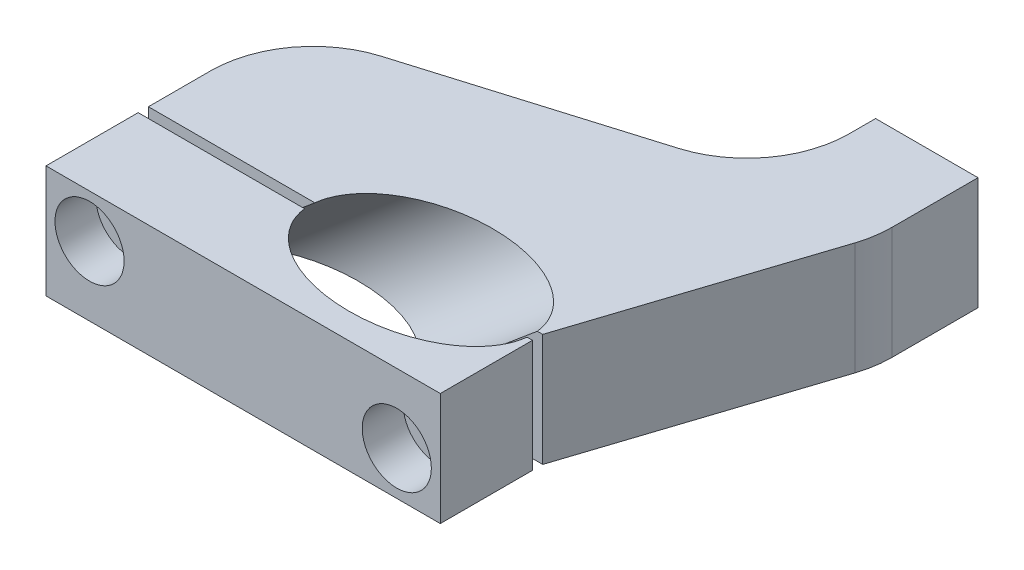
ISO-10303-21;
HEADER;
FILE_DESCRIPTION(('STEP AP214'),'2;1');
FILE_NAME('part.step','',(''),(''),'','','');
FILE_SCHEMA(('AUTOMOTIVE_DESIGN { 1 0 10303 214 1 1 1 1 }'));
ENDSEC;
DATA;
#1=APPLICATION_CONTEXT('core data for automotive mechanical design processes');
#2=APPLICATION_PROTOCOL_DEFINITION('international standard','automotive_design',2000,#1);
#3=PRODUCT_CONTEXT('',#1,'mechanical');
#4=PRODUCT('Part','Part','',(#3));
#5=PRODUCT_RELATED_PRODUCT_CATEGORY('part','',(#4));
#6=PRODUCT_DEFINITION_FORMATION('','',#4);
#7=PRODUCT_DEFINITION_CONTEXT('part definition',#1,'design');
#8=PRODUCT_DEFINITION('design','',#6,#7);
#9=PRODUCT_DEFINITION_SHAPE('','',#8);
#10=(LENGTH_UNIT() NAMED_UNIT(*) SI_UNIT(.MILLI.,.METRE.));
#11=(NAMED_UNIT(*) PLANE_ANGLE_UNIT() SI_UNIT($,.RADIAN.));
#12=(NAMED_UNIT(*) SI_UNIT($,.STERADIAN.) SOLID_ANGLE_UNIT());
#13=UNCERTAINTY_MEASURE_WITH_UNIT(LENGTH_MEASURE(1.E-05),#10,'distance_accuracy_value','');
#14=(GEOMETRIC_REPRESENTATION_CONTEXT(3) GLOBAL_UNCERTAINTY_ASSIGNED_CONTEXT((#13)) GLOBAL_UNIT_ASSIGNED_CONTEXT((#10,
#11,#12)) REPRESENTATION_CONTEXT('',''));
#15=CARTESIAN_POINT('',(0.,0.,0.));
#16=DIRECTION('',(0.,0.,1.));
#17=DIRECTION('',(1.,0.,0.));
#18=AXIS2_PLACEMENT_3D('',#15,#16,#17);
#19=CARTESIAN_POINT('',(-28.,22.,1.));
#20=DIRECTION('',(0.,0.,1.));
#21=DIRECTION('',(1.,0.,0.));
#22=AXIS2_PLACEMENT_3D('',#19,#20,#21);
#23=PLANE('',#22);
#24=CARTESIAN_POINT('',(-19.5,13.5,1.));
#25=DIRECTION('',(0.,0.,1.));
#26=DIRECTION('',(1.,0.,0.));
#27=AXIS2_PLACEMENT_3D('',#24,#25,#26);
#28=CIRCLE('',#27,4.);
#29=CARTESIAN_POINT('',(-15.5,13.5,1.));
#30=VERTEX_POINT('',#29);
#31=EDGE_CURVE('E168',#30,#30,#28,.T.);
#32=ORIENTED_EDGE('',*,*,#31,.T.);
#33=EDGE_LOOP('',(#32));
#34=FACE_BOUND('',#33,.T.);
#35=DIRECTION('',(-0.766044443118977,-0.64278760968654,0.));
#36=VECTOR('',#35,1.);
#37=CARTESIAN_POINT('',(-51.108484850367,-24.656090044851,1.));
#38=LINE('',#37,#36);
#39=CARTESIAN_POINT('',(-21.7245009600896,0.,1.));
#40=VERTEX_POINT('',#39);
#41=CARTESIAN_POINT('',(4.49407807698295,22.,1.));
#42=VERTEX_POINT('',#41);
#43=EDGE_CURVE('E118',#40,#42,#38,.F.);
#44=ORIENTED_EDGE('',*,*,#43,.F.);
#45=DIRECTION('',(-1.,0.,0.));
#46=VECTOR('',#45,1.);
#47=CARTESIAN_POINT('',(-28.,0.,1.));
#48=LINE('',#47,#46);
#49=CARTESIAN_POINT('',(-28.,0.,1.));
#50=VERTEX_POINT('',#49);
#51=EDGE_CURVE('E102',#40,#50,#48,.T.);
#52=ORIENTED_EDGE('',*,*,#51,.T.);
#53=DIRECTION('',(0.,-1.,0.));
#54=VECTOR('',#53,1.);
#55=CARTESIAN_POINT('',(-28.,22.,1.));
#56=LINE('',#55,#54);
#57=CARTESIAN_POINT('',(-28.,22.,1.));
#58=VERTEX_POINT('',#57);
#59=EDGE_CURVE('E136',#58,#50,#56,.T.);
#60=ORIENTED_EDGE('',*,*,#59,.F.);
#61=DIRECTION('',(-1.,0.,0.));
#62=VECTOR('',#61,1.);
#63=CARTESIAN_POINT('',(-28.,22.,1.));
#64=LINE('',#63,#62);
#65=EDGE_CURVE('E80',#42,#58,#64,.T.);
#66=ORIENTED_EDGE('',*,*,#65,.F.);
#67=EDGE_LOOP('',(#44,#52,#60,#66));
#68=FACE_BOUND('',#67,.T.);
#69=ADVANCED_FACE('F57',(#34,#68),#23,.F.);
#70=CARTESIAN_POINT('',(40.5,8.5,1.));
#71=DIRECTION('',(0.,0.,1.));
#72=DIRECTION('',(1.,0.,0.));
#73=AXIS2_PLACEMENT_3D('',#70,#71,#72);
#74=CIRCLE('',#73,4.);
#75=CARTESIAN_POINT('',(44.5,8.5,1.));
#76=VERTEX_POINT('',#75);
#77=EDGE_CURVE('E173',#76,#76,#74,.T.);
#78=ORIENTED_EDGE('',*,*,#77,.T.);
#79=EDGE_LOOP('',(#78));
#80=FACE_BOUND('',#79,.T.);
#81=DIRECTION('',(-0.766044443118977,-0.64278760968654,0.));
#82=VECTOR('',#81,1.);
#83=CARTESIAN_POINT('',(-33.1564038927204,-46.0505470206684,1.));
#84=LINE('',#83,#82);
#85=CARTESIAN_POINT('',(47.9430799971621,22.,1.));
#86=VERTEX_POINT('',#85);
#87=CARTESIAN_POINT('',(21.7245009600896,0.,1.));
#88=VERTEX_POINT('',#87);
#89=EDGE_CURVE('E72',#86,#88,#84,.T.);
#90=ORIENTED_EDGE('',*,*,#89,.F.);
#91=CARTESIAN_POINT('',(49.,22.,1.));
#92=VERTEX_POINT('',#91);
#93=EDGE_CURVE('E139',#92,#86,#64,.T.);
#94=ORIENTED_EDGE('',*,*,#93,.F.);
#95=DIRECTION('',(0.,-1.,0.));
#96=VECTOR('',#95,1.);
#97=CARTESIAN_POINT('',(49.,22.,1.));
#98=LINE('',#97,#96);
#99=CARTESIAN_POINT('',(49.,0.,1.));
#100=VERTEX_POINT('',#99);
#101=EDGE_CURVE('E138',#92,#100,#98,.T.);
#102=ORIENTED_EDGE('',*,*,#101,.T.);
#103=EDGE_CURVE('E128',#100,#88,#48,.T.);
#104=ORIENTED_EDGE('',*,*,#103,.T.);
#105=EDGE_LOOP('',(#90,#94,#102,#104));
#106=FACE_BOUND('',#105,.T.);
#107=ADVANCED_FACE('F210',(#80,#106),#23,.F.);
#108=CARTESIAN_POINT('',(0.,22.,0.));
#109=DIRECTION('',(0.,-1.,0.));
#110=DIRECTION('',(0.,0.,-1.));
#111=AXIS2_PLACEMENT_3D('',#108,#109,#110);
#112=PLANE('',#111);
#113=CARTESIAN_POINT('',(26.2185790370725,22.,0.));
#114=DIRECTION('',(0.,-1.,0.));
#115=DIRECTION('',(-1.,0.,0.));
#116=AXIS2_PLACEMENT_3D('',#113,#114,#115);
#117=ELLIPSE('',#116,21.7801335760457,14.);
#118=EDGE_CURVE('E122',#42,#86,#117,.F.);
#119=ORIENTED_EDGE('',*,*,#118,.F.);
#120=ORIENTED_EDGE('',*,*,#65,.T.);
#121=DIRECTION('',(0.,0.,1.));
#122=VECTOR('',#121,1.);
#123=CARTESIAN_POINT('',(-28.,22.,1.));
#124=LINE('',#123,#122);
#125=CARTESIAN_POINT('',(-28.,22.,19.));
#126=VERTEX_POINT('',#125);
#127=EDGE_CURVE('E131',#58,#126,#124,.T.);
#128=ORIENTED_EDGE('',*,*,#127,.T.);
#129=DIRECTION('',(1.,0.,0.));
#130=VECTOR('',#129,1.);
#131=CARTESIAN_POINT('',(49.,22.,19.));
#132=LINE('',#131,#130);
#133=CARTESIAN_POINT('',(49.,22.,19.));
#134=VERTEX_POINT('',#133);
#135=EDGE_CURVE('E110',#126,#134,#132,.T.);
#136=ORIENTED_EDGE('',*,*,#135,.T.);
#137=DIRECTION('',(0.,0.,-1.));
#138=VECTOR('',#137,1.);
#139=CARTESIAN_POINT('',(49.,22.,1.));
#140=LINE('',#139,#138);
#141=EDGE_CURVE('E153',#134,#92,#140,.T.);
#142=ORIENTED_EDGE('',*,*,#141,.T.);
#143=ORIENTED_EDGE('',*,*,#93,.T.);
#144=EDGE_LOOP('',(#119,#120,#128,#136,#142,#143));
#145=FACE_BOUND('',#144,.T.);
#146=ADVANCED_FACE('F216',(#145),#112,.F.);
#147=CARTESIAN_POINT('',(0.,0.,0.));
#148=DIRECTION('',(0.,-1.,0.));
#149=DIRECTION('',(0.,0.,-1.));
#150=AXIS2_PLACEMENT_3D('',#147,#148,#149);
#151=PLANE('',#150);
#152=ORIENTED_EDGE('',*,*,#51,.F.);
#153=CARTESIAN_POINT('',(0.,0.,0.));
#154=DIRECTION('',(0.,-1.,0.));
#155=DIRECTION('',(-1.,0.,0.));
#156=AXIS2_PLACEMENT_3D('',#153,#154,#155);
#157=ELLIPSE('',#156,21.7801335760457,14.);
#158=EDGE_CURVE('E14',#40,#88,#157,.F.);
#159=ORIENTED_EDGE('',*,*,#158,.T.);
#160=ORIENTED_EDGE('',*,*,#103,.F.);
#161=DIRECTION('',(0.,0.,-1.));
#162=VECTOR('',#161,1.);
#163=CARTESIAN_POINT('',(49.,0.,1.));
#164=LINE('',#163,#162);
#165=CARTESIAN_POINT('',(49.,0.,19.));
#166=VERTEX_POINT('',#165);
#167=EDGE_CURVE('E129',#166,#100,#164,.T.);
#168=ORIENTED_EDGE('',*,*,#167,.F.);
#169=DIRECTION('',(1.,0.,0.));
#170=VECTOR('',#169,1.);
#171=CARTESIAN_POINT('',(49.,0.,19.));
#172=LINE('',#171,#170);
#173=CARTESIAN_POINT('',(-28.,0.,19.));
#174=VERTEX_POINT('',#173);
#175=EDGE_CURVE('E132',#174,#166,#172,.T.);
#176=ORIENTED_EDGE('',*,*,#175,.F.);
#177=DIRECTION('',(0.,0.,1.));
#178=VECTOR('',#177,1.);
#179=CARTESIAN_POINT('',(-28.,0.,1.));
#180=LINE('',#179,#178);
#181=EDGE_CURVE('E127',#50,#174,#180,.T.);
#182=ORIENTED_EDGE('',*,*,#181,.F.);
#183=EDGE_LOOP('',(#152,#159,#160,#168,#176,#182));
#184=FACE_BOUND('',#183,.T.);
#185=ADVANCED_FACE('F125',(#184),#151,.T.);
#186=CARTESIAN_POINT('',(-28.,22.,1.));
#187=DIRECTION('',(1.,0.,0.));
#188=DIRECTION('',(0.,0.,-1.));
#189=AXIS2_PLACEMENT_3D('',#186,#187,#188);
#190=PLANE('',#189);
#191=ORIENTED_EDGE('',*,*,#181,.T.);
#192=DIRECTION('',(0.,-1.,0.));
#193=VECTOR('',#192,1.);
#194=CARTESIAN_POINT('',(-28.,22.,19.));
#195=LINE('',#194,#193);
#196=EDGE_CURVE('E65',#126,#174,#195,.T.);
#197=ORIENTED_EDGE('',*,*,#196,.F.);
#198=ORIENTED_EDGE('',*,*,#127,.F.);
#199=ORIENTED_EDGE('',*,*,#59,.T.);
#200=EDGE_LOOP('',(#191,#197,#198,#199));
#201=FACE_BOUND('',#200,.T.);
#202=ADVANCED_FACE('F59',(#201),#190,.F.);
#203=CARTESIAN_POINT('',(49.,22.,19.));
#204=DIRECTION('',(0.,0.,-1.));
#205=DIRECTION('',(-1.,0.,0.));
#206=AXIS2_PLACEMENT_3D('',#203,#204,#205);
#207=PLANE('',#206);
#208=CARTESIAN_POINT('',(40.5,8.5,19.));
#209=DIRECTION('',(0.,0.,1.));
#210=DIRECTION('',(1.,0.,0.));
#211=AXIS2_PLACEMENT_3D('',#208,#209,#210);
#212=CIRCLE('',#211,6.75);
#213=CARTESIAN_POINT('',(47.25,8.5,19.));
#214=VERTEX_POINT('',#213);
#215=EDGE_CURVE('E162',#214,#214,#212,.T.);
#216=ORIENTED_EDGE('',*,*,#215,.F.);
#217=EDGE_LOOP('',(#216));
#218=FACE_BOUND('',#217,.T.);
#219=CARTESIAN_POINT('',(-19.5,13.5,19.));
#220=DIRECTION('',(0.,0.,1.));
#221=DIRECTION('',(1.,0.,0.));
#222=AXIS2_PLACEMENT_3D('',#219,#220,#221);
#223=CIRCLE('',#222,6.75);
#224=CARTESIAN_POINT('',(-12.75,13.5,19.));
#225=VERTEX_POINT('',#224);
#226=EDGE_CURVE('E159',#225,#225,#223,.T.);
#227=ORIENTED_EDGE('',*,*,#226,.F.);
#228=EDGE_LOOP('',(#227));
#229=FACE_BOUND('',#228,.T.);
#230=ORIENTED_EDGE('',*,*,#175,.T.);
#231=DIRECTION('',(0.,-1.,0.));
#232=VECTOR('',#231,1.);
#233=CARTESIAN_POINT('',(49.,22.,19.));
#234=LINE('',#233,#232);
#235=EDGE_CURVE('E142',#134,#166,#234,.T.);
#236=ORIENTED_EDGE('',*,*,#235,.F.);
#237=ORIENTED_EDGE('',*,*,#135,.F.);
#238=ORIENTED_EDGE('',*,*,#196,.T.);
#239=EDGE_LOOP('',(#230,#236,#237,#238));
#240=FACE_BOUND('',#239,.T.);
#241=ADVANCED_FACE('F145',(#218,#229,#240),#207,.F.);
#242=CARTESIAN_POINT('',(49.,22.,1.));
#243=DIRECTION('',(-1.,0.,0.));
#244=DIRECTION('',(0.,0.,1.));
#245=AXIS2_PLACEMENT_3D('',#242,#243,#244);
#246=PLANE('',#245);
#247=ORIENTED_EDGE('',*,*,#167,.T.);
#248=ORIENTED_EDGE('',*,*,#101,.F.);
#249=ORIENTED_EDGE('',*,*,#141,.F.);
#250=ORIENTED_EDGE('',*,*,#235,.T.);
#251=EDGE_LOOP('',(#247,#248,#249,#250));
#252=FACE_BOUND('',#251,.T.);
#253=ADVANCED_FACE('F200',(#252),#246,.F.);
#254=CARTESIAN_POINT('',(-42.1324443715437,-35.3533185327597,0.));
#255=DIRECTION('',(-0.766044443118977,-0.64278760968654,0.));
#256=DIRECTION('',(0.642787609686541,-0.766044443118977,0.));
#257=AXIS2_PLACEMENT_3D('',#254,#255,#256);
#258=CYLINDRICAL_SURFACE('',#257,14.);
#259=ORIENTED_EDGE('',*,*,#118,.T.);
#260=ORIENTED_EDGE('',*,*,#89,.T.);
#261=ORIENTED_EDGE('',*,*,#158,.F.);
#262=ORIENTED_EDGE('',*,*,#43,.T.);
#263=EDGE_LOOP('',(#259,#260,#261,#262));
#264=FACE_BOUND('',#263,.T.);
#265=ADVANCED_FACE('F117',(#264),#258,.F.);
#266=CARTESIAN_POINT('',(-19.5,13.5,11.));
#267=DIRECTION('',(0.,0.,1.));
#268=DIRECTION('',(1.,0.,0.));
#269=AXIS2_PLACEMENT_3D('',#266,#267,#268);
#270=CYLINDRICAL_SURFACE('',#269,6.75);
#271=CARTESIAN_POINT('',(-19.5,13.5,11.));
#272=DIRECTION('',(0.,0.,1.));
#273=DIRECTION('',(1.,0.,0.));
#274=AXIS2_PLACEMENT_3D('',#271,#272,#273);
#275=CIRCLE('',#274,6.75);
#276=CARTESIAN_POINT('',(-12.75,13.5,11.));
#277=VERTEX_POINT('',#276);
#278=EDGE_CURVE('E158',#277,#277,#275,.T.);
#279=ORIENTED_EDGE('',*,*,#278,.F.);
#280=EDGE_LOOP('',(#279));
#281=FACE_BOUND('',#280,.T.);
#282=ORIENTED_EDGE('',*,*,#226,.T.);
#283=EDGE_LOOP('',(#282));
#284=FACE_BOUND('',#283,.T.);
#285=ADVANCED_FACE('F190',(#281,#284),#270,.F.);
#286=CARTESIAN_POINT('',(-19.5,13.5,11.));
#287=DIRECTION('',(0.,0.,1.));
#288=DIRECTION('',(1.,0.,0.));
#289=AXIS2_PLACEMENT_3D('',#286,#287,#288);
#290=PLANE('',#289);
#291=CARTESIAN_POINT('',(-19.5,13.5,11.));
#292=DIRECTION('',(0.,0.,1.));
#293=DIRECTION('',(1.,0.,0.));
#294=AXIS2_PLACEMENT_3D('',#291,#292,#293);
#295=CIRCLE('',#294,4.);
#296=CARTESIAN_POINT('',(-15.5,13.5,11.));
#297=VERTEX_POINT('',#296);
#298=EDGE_CURVE('E176',#297,#297,#295,.T.);
#299=ORIENTED_EDGE('',*,*,#298,.F.);
#300=EDGE_LOOP('',(#299));
#301=FACE_BOUND('',#300,.T.);
#302=ORIENTED_EDGE('',*,*,#278,.T.);
#303=EDGE_LOOP('',(#302));
#304=FACE_BOUND('',#303,.T.);
#305=ADVANCED_FACE('F186',(#301,#304),#290,.T.);
#306=CARTESIAN_POINT('',(40.5,8.5,11.));
#307=DIRECTION('',(0.,0.,1.));
#308=DIRECTION('',(1.,0.,0.));
#309=AXIS2_PLACEMENT_3D('',#306,#307,#308);
#310=CYLINDRICAL_SURFACE('',#309,6.75);
#311=CARTESIAN_POINT('',(40.5,8.5,11.));
#312=DIRECTION('',(0.,0.,1.));
#313=DIRECTION('',(1.,0.,0.));
#314=AXIS2_PLACEMENT_3D('',#311,#312,#313);
#315=CIRCLE('',#314,6.75);
#316=CARTESIAN_POINT('',(47.25,8.5,11.));
#317=VERTEX_POINT('',#316);
#318=EDGE_CURVE('E165',#317,#317,#315,.T.);
#319=ORIENTED_EDGE('',*,*,#318,.F.);
#320=EDGE_LOOP('',(#319));
#321=FACE_BOUND('',#320,.T.);
#322=ORIENTED_EDGE('',*,*,#215,.T.);
#323=EDGE_LOOP('',(#322));
#324=FACE_BOUND('',#323,.T.);
#325=ADVANCED_FACE('F189',(#321,#324),#310,.F.);
#326=CARTESIAN_POINT('',(40.5,8.5,11.));
#327=DIRECTION('',(0.,0.,1.));
#328=DIRECTION('',(1.,0.,0.));
#329=AXIS2_PLACEMENT_3D('',#326,#327,#328);
#330=PLANE('',#329);
#331=CARTESIAN_POINT('',(40.5,8.5,11.));
#332=DIRECTION('',(0.,0.,1.));
#333=DIRECTION('',(1.,0.,0.));
#334=AXIS2_PLACEMENT_3D('',#331,#332,#333);
#335=CIRCLE('',#334,4.);
#336=CARTESIAN_POINT('',(44.5,8.5,11.));
#337=VERTEX_POINT('',#336);
#338=EDGE_CURVE('E177',#337,#337,#335,.T.);
#339=ORIENTED_EDGE('',*,*,#338,.F.);
#340=EDGE_LOOP('',(#339));
#341=FACE_BOUND('',#340,.T.);
#342=ORIENTED_EDGE('',*,*,#318,.T.);
#343=EDGE_LOOP('',(#342));
#344=FACE_BOUND('',#343,.T.);
#345=ADVANCED_FACE('F225',(#341,#344),#330,.T.);
#346=CARTESIAN_POINT('',(40.5,8.5,-19.));
#347=DIRECTION('',(0.,0.,1.));
#348=DIRECTION('',(1.,0.,0.));
#349=AXIS2_PLACEMENT_3D('',#346,#347,#348);
#350=CYLINDRICAL_SURFACE('',#349,4.);
#351=ORIENTED_EDGE('',*,*,#338,.T.);
#352=EDGE_LOOP('',(#351));
#353=FACE_BOUND('',#352,.T.);
#354=ORIENTED_EDGE('',*,*,#77,.F.);
#355=EDGE_LOOP('',(#354));
#356=FACE_BOUND('',#355,.T.);
#357=ADVANCED_FACE('F228',(#353,#356),#350,.F.);
#358=CARTESIAN_POINT('',(-19.5,13.5,-19.));
#359=DIRECTION('',(0.,0.,1.));
#360=DIRECTION('',(1.,0.,0.));
#361=AXIS2_PLACEMENT_3D('',#358,#359,#360);
#362=CYLINDRICAL_SURFACE('',#361,4.);
#363=ORIENTED_EDGE('',*,*,#298,.T.);
#364=EDGE_LOOP('',(#363));
#365=FACE_BOUND('',#364,.T.);
#366=ORIENTED_EDGE('',*,*,#31,.F.);
#367=EDGE_LOOP('',(#366));
#368=FACE_BOUND('',#367,.T.);
#369=ADVANCED_FACE('F183',(#365,#368),#362,.F.);
#370=CLOSED_SHELL('',(#69,#107,#146,#185,#202,#241,#253,#265,#285,#305,#325,#345,#357,#369));
#371=MANIFOLD_SOLID_BREP('B2',#370);
#372=CARTESIAN_POINT('',(-28.,22.,-1.));
#373=DIRECTION('',(0.,0.,-1.));
#374=DIRECTION('',(-1.,0.,0.));
#375=AXIS2_PLACEMENT_3D('',#372,#373,#374);
#376=PLANE('',#375);
#377=CARTESIAN_POINT('',(40.5,8.5,-1.));
#378=DIRECTION('',(0.,0.,-1.));
#379=DIRECTION('',(-1.,0.,0.));
#380=AXIS2_PLACEMENT_3D('',#377,#378,#379);
#381=CIRCLE('',#380,4.);
#382=CARTESIAN_POINT('',(36.5,8.5,-1.));
#383=VERTEX_POINT('',#382);
#384=EDGE_CURVE('E500',#383,#383,#381,.T.);
#385=ORIENTED_EDGE('',*,*,#384,.T.);
#386=EDGE_LOOP('',(#385));
#387=FACE_BOUND('',#386,.T.);
#388=DIRECTION('',(-0.766044443118977,-0.64278760968654,0.));
#389=VECTOR('',#388,1.);
#390=CARTESIAN_POINT('',(-33.1564038927204,-46.0505470206684,-1.));
#391=LINE('',#390,#389);
#392=CARTESIAN_POINT('',(21.7245009600896,0.,-1.));
#393=VERTEX_POINT('',#392);
#394=CARTESIAN_POINT('',(47.9430799971621,22.,-1.));
#395=VERTEX_POINT('',#394);
#396=EDGE_CURVE('E429',#393,#395,#391,.F.);
#397=ORIENTED_EDGE('',*,*,#396,.F.);
#398=DIRECTION('',(1.,0.,0.));
#399=VECTOR('',#398,1.);
#400=CARTESIAN_POINT('',(-28.,0.,-1.));
#401=LINE('',#400,#399);
#402=CARTESIAN_POINT('',(49.,0.,-1.));
#403=VERTEX_POINT('',#402);
#404=EDGE_CURVE('E442',#393,#403,#401,.T.);
#405=ORIENTED_EDGE('',*,*,#404,.T.);
#406=DIRECTION('',(0.,-1.,0.));
#407=VECTOR('',#406,1.);
#408=CARTESIAN_POINT('',(49.,22.,-1.));
#409=LINE('',#408,#407);
#410=CARTESIAN_POINT('',(49.,22.,-1.));
#411=VERTEX_POINT('',#410);
#412=EDGE_CURVE('E475',#411,#403,#409,.T.);
#413=ORIENTED_EDGE('',*,*,#412,.F.);
#414=DIRECTION('',(1.,0.,0.));
#415=VECTOR('',#414,1.);
#416=CARTESIAN_POINT('',(-28.,22.,-1.));
#417=LINE('',#416,#415);
#418=EDGE_CURVE('E444',#395,#411,#417,.T.);
#419=ORIENTED_EDGE('',*,*,#418,.F.);
#420=EDGE_LOOP('',(#397,#405,#413,#419));
#421=FACE_BOUND('',#420,.T.);
#422=ADVANCED_FACE('F338',(#387,#421),#376,.F.);
#423=CARTESIAN_POINT('',(-19.5,13.5,-1.));
#424=DIRECTION('',(0.,0.,-1.));
#425=DIRECTION('',(-1.,0.,0.));
#426=AXIS2_PLACEMENT_3D('',#423,#424,#425);
#427=CIRCLE('',#426,4.);
#428=CARTESIAN_POINT('',(-23.5,13.5,-1.));
#429=VERTEX_POINT('',#428);
#430=EDGE_CURVE('E497',#429,#429,#427,.T.);
#431=ORIENTED_EDGE('',*,*,#430,.T.);
#432=EDGE_LOOP('',(#431));
#433=FACE_BOUND('',#432,.T.);
#434=DIRECTION('',(-0.766044443118977,-0.64278760968654,0.));
#435=VECTOR('',#434,1.);
#436=CARTESIAN_POINT('',(-51.108484850367,-24.656090044851,-1.));
#437=LINE('',#436,#435);
#438=CARTESIAN_POINT('',(4.49407807698295,22.,-1.));
#439=VERTEX_POINT('',#438);
#440=CARTESIAN_POINT('',(-21.7245009600896,0.,-1.));
#441=VERTEX_POINT('',#440);
#442=EDGE_CURVE('E432',#439,#441,#437,.T.);
#443=ORIENTED_EDGE('',*,*,#442,.F.);
#444=CARTESIAN_POINT('',(-28.,22.,-1.));
#445=VERTEX_POINT('',#444);
#446=EDGE_CURVE('E518',#445,#439,#417,.T.);
#447=ORIENTED_EDGE('',*,*,#446,.F.);
#448=DIRECTION('',(0.,-1.,0.));
#449=VECTOR('',#448,1.);
#450=CARTESIAN_POINT('',(-28.,22.,-1.));
#451=LINE('',#450,#449);
#452=CARTESIAN_POINT('',(-28.,0.,-1.));
#453=VERTEX_POINT('',#452);
#454=EDGE_CURVE('E437',#445,#453,#451,.T.);
#455=ORIENTED_EDGE('',*,*,#454,.T.);
#456=EDGE_CURVE('E451',#453,#441,#401,.T.);
#457=ORIENTED_EDGE('',*,*,#456,.T.);
#458=EDGE_LOOP('',(#443,#447,#455,#457));
#459=FACE_BOUND('',#458,.T.);
#460=ADVANCED_FACE('F516',(#433,#459),#376,.F.);
#461=CARTESIAN_POINT('',(0.,22.,0.));
#462=DIRECTION('',(0.,1.,0.));
#463=DIRECTION('',(0.,0.,1.));
#464=AXIS2_PLACEMENT_3D('',#461,#462,#463);
#465=PLANE('',#464);
#466=DIRECTION('',(-0.95746453985962,0.,0.288550957217968));
#467=VECTOR('',#466,1.);
#468=CARTESIAN_POINT('',(-28.,22.,-28.));
#469=LINE('',#468,#467);
#470=CARTESIAN_POINT('',(30.7710191443594,22.,-45.7118139887111));
#471=VERTEX_POINT('',#470);
#472=CARTESIAN_POINT('',(-13.7710191443594,22.,-32.288186011289));
#473=VERTEX_POINT('',#472);
#474=EDGE_CURVE('E472',#471,#473,#469,.T.);
#475=ORIENTED_EDGE('',*,*,#474,.T.);
#476=CARTESIAN_POINT('',(-8.,22.,-13.1388952140966));
#477=DIRECTION('',(0.,1.,0.));
#478=DIRECTION('',(0.,0.,1.));
#479=AXIS2_PLACEMENT_3D('',#476,#477,#478);
#480=CIRCLE('',#479,20.);
#481=CARTESIAN_POINT('',(-28.,22.,-13.1388952140966));
#482=VERTEX_POINT('',#481);
#483=EDGE_CURVE('E55',#473,#482,#480,.T.);
#484=ORIENTED_EDGE('',*,*,#483,.T.);
#485=DIRECTION('',(0.,0.,1.));
#486=VECTOR('',#485,1.);
#487=CARTESIAN_POINT('',(-28.,22.,-28.));
#488=LINE('',#487,#486);
#489=EDGE_CURVE('E467',#482,#445,#488,.T.);
#490=ORIENTED_EDGE('',*,*,#489,.T.);
#491=ORIENTED_EDGE('',*,*,#446,.T.);
#492=CARTESIAN_POINT('',(26.2185790370725,22.,0.));
#493=DIRECTION('',(0.,1.,0.));
#494=DIRECTION('',(-1.,0.,0.));
#495=AXIS2_PLACEMENT_3D('',#492,#493,#494);
#496=ELLIPSE('',#495,21.7801335760457,14.);
#497=EDGE_CURVE('E445',#439,#395,#496,.F.);
#498=ORIENTED_EDGE('',*,*,#497,.T.);
#499=ORIENTED_EDGE('',*,*,#418,.T.);
#500=DIRECTION('',(0.310401781711341,0.,-0.95060545649098));
#501=VECTOR('',#500,1.);
#502=CARTESIAN_POINT('',(65.,22.,-50.));
#503=LINE('',#502,#501);
#504=CARTESIAN_POINT('',(64.0121091298196,22.,-46.9745842100726));
#505=VERTEX_POINT('',#504);
#506=EDGE_CURVE('E520',#411,#505,#503,.T.);
#507=ORIENTED_EDGE('',*,*,#506,.T.);
#508=CARTESIAN_POINT('',(45.,22.,-53.1826198442994));
#509=DIRECTION('',(0.,1.,0.));
#510=DIRECTION('',(0.,0.,1.));
#511=AXIS2_PLACEMENT_3D('',#508,#509,#510);
#512=CIRCLE('',#511,20.);
#513=CARTESIAN_POINT('',(65.,22.,-53.1826198442994));
#514=VERTEX_POINT('',#513);
#515=EDGE_CURVE('E494',#505,#514,#512,.T.);
#516=ORIENTED_EDGE('',*,*,#515,.T.);
#517=DIRECTION('',(0.,0.,-1.));
#518=VECTOR('',#517,1.);
#519=CARTESIAN_POINT('',(65.,22.,-70.));
#520=LINE('',#519,#518);
#521=CARTESIAN_POINT('',(65.,22.,-70.));
#522=VERTEX_POINT('',#521);
#523=EDGE_CURVE('E523',#514,#522,#520,.T.);
#524=ORIENTED_EDGE('',*,*,#523,.T.);
#525=DIRECTION('',(-1.,0.,0.));
#526=VECTOR('',#525,1.);
#527=CARTESIAN_POINT('',(45.,22.,-70.));
#528=LINE('',#527,#526);
#529=CARTESIAN_POINT('',(45.,22.,-70.));
#530=VERTEX_POINT('',#529);
#531=EDGE_CURVE('E529',#522,#530,#528,.T.);
#532=ORIENTED_EDGE('',*,*,#531,.T.);
#533=DIRECTION('',(0.,0.,1.));
#534=VECTOR('',#533,1.);
#535=CARTESIAN_POINT('',(45.,22.,-70.));
#536=LINE('',#535,#534);
#537=CARTESIAN_POINT('',(45.,22.,-64.8611047859034));
#538=VERTEX_POINT('',#537);
#539=EDGE_CURVE('E531',#530,#538,#536,.T.);
#540=ORIENTED_EDGE('',*,*,#539,.T.);
#541=CARTESIAN_POINT('',(25.,22.,-64.8611047859034));
#542=DIRECTION('',(0.,1.,0.));
#543=DIRECTION('',(0.,0.,1.));
#544=AXIS2_PLACEMENT_3D('',#541,#542,#543);
#545=CIRCLE('',#544,20.);
#546=EDGE_CURVE('E485',#538,#471,#545,.F.);
#547=ORIENTED_EDGE('',*,*,#546,.T.);
#548=EDGE_LOOP('',(#475,#484,#490,#491,#498,#499,#507,#516,#524,#532,#540,#547));
#549=FACE_BOUND('',#548,.T.);
#550=ADVANCED_FACE('F533',(#549),#465,.T.);
#551=CARTESIAN_POINT('',(0.,0.,0.));
#552=DIRECTION('',(0.,1.,0.));
#553=DIRECTION('',(0.,0.,1.));
#554=AXIS2_PLACEMENT_3D('',#551,#552,#553);
#555=PLANE('',#554);
#556=DIRECTION('',(0.,0.,1.));
#557=VECTOR('',#556,1.);
#558=CARTESIAN_POINT('',(-28.,0.,-28.));
#559=LINE('',#558,#557);
#560=CARTESIAN_POINT('',(-28.,0.,-13.1388952140966));
#561=VERTEX_POINT('',#560);
#562=EDGE_CURVE('E452',#561,#453,#559,.T.);
#563=ORIENTED_EDGE('',*,*,#562,.F.);
#564=CARTESIAN_POINT('',(-8.,0.,-13.1388952140966));
#565=DIRECTION('',(0.,1.,0.));
#566=DIRECTION('',(0.,0.,1.));
#567=AXIS2_PLACEMENT_3D('',#564,#565,#566);
#568=CIRCLE('',#567,20.);
#569=CARTESIAN_POINT('',(-13.7710191443594,0.,-32.288186011289));
#570=VERTEX_POINT('',#569);
#571=EDGE_CURVE('E360',#561,#570,#568,.F.);
#572=ORIENTED_EDGE('',*,*,#571,.T.);
#573=DIRECTION('',(-0.95746453985962,0.,0.288550957217968));
#574=VECTOR('',#573,1.);
#575=CARTESIAN_POINT('',(-28.,0.,-28.));
#576=LINE('',#575,#574);
#577=CARTESIAN_POINT('',(30.7710191443594,0.,-45.7118139887111));
#578=VERTEX_POINT('',#577);
#579=EDGE_CURVE('E465',#578,#570,#576,.T.);
#580=ORIENTED_EDGE('',*,*,#579,.F.);
#581=CARTESIAN_POINT('',(25.,0.,-64.8611047859034));
#582=DIRECTION('',(0.,1.,0.));
#583=DIRECTION('',(0.,0.,1.));
#584=AXIS2_PLACEMENT_3D('',#581,#582,#583);
#585=CIRCLE('',#584,20.);
#586=CARTESIAN_POINT('',(45.,0.,-64.8611047859034));
#587=VERTEX_POINT('',#586);
#588=EDGE_CURVE('E483',#578,#587,#585,.T.);
#589=ORIENTED_EDGE('',*,*,#588,.T.);
#590=DIRECTION('',(0.,0.,1.));
#591=VECTOR('',#590,1.);
#592=CARTESIAN_POINT('',(45.,0.,-70.));
#593=LINE('',#592,#591);
#594=CARTESIAN_POINT('',(45.,0.,-70.));
#595=VERTEX_POINT('',#594);
#596=EDGE_CURVE('E462',#595,#587,#593,.T.);
#597=ORIENTED_EDGE('',*,*,#596,.F.);
#598=DIRECTION('',(-1.,0.,0.));
#599=VECTOR('',#598,1.);
#600=CARTESIAN_POINT('',(45.,0.,-70.));
#601=LINE('',#600,#599);
#602=CARTESIAN_POINT('',(65.,0.,-70.));
#603=VERTEX_POINT('',#602);
#604=EDGE_CURVE('E460',#603,#595,#601,.T.);
#605=ORIENTED_EDGE('',*,*,#604,.F.);
#606=DIRECTION('',(0.,0.,-1.));
#607=VECTOR('',#606,1.);
#608=CARTESIAN_POINT('',(65.,0.,-70.));
#609=LINE('',#608,#607);
#610=CARTESIAN_POINT('',(65.,0.,-53.1826198442994));
#611=VERTEX_POINT('',#610);
#612=EDGE_CURVE('E458',#611,#603,#609,.T.);
#613=ORIENTED_EDGE('',*,*,#612,.F.);
#614=CARTESIAN_POINT('',(45.,0.,-53.1826198442994));
#615=DIRECTION('',(0.,1.,0.));
#616=DIRECTION('',(0.,0.,1.));
#617=AXIS2_PLACEMENT_3D('',#614,#615,#616);
#618=CIRCLE('',#617,20.);
#619=CARTESIAN_POINT('',(64.0121091298196,0.,-46.9745842100726));
#620=VERTEX_POINT('',#619);
#621=EDGE_CURVE('E490',#611,#620,#618,.F.);
#622=ORIENTED_EDGE('',*,*,#621,.T.);
#623=DIRECTION('',(0.310401781711341,0.,-0.95060545649098));
#624=VECTOR('',#623,1.);
#625=CARTESIAN_POINT('',(65.,0.,-50.));
#626=LINE('',#625,#624);
#627=EDGE_CURVE('E450',#403,#620,#626,.T.);
#628=ORIENTED_EDGE('',*,*,#627,.F.);
#629=ORIENTED_EDGE('',*,*,#404,.F.);
#630=CARTESIAN_POINT('',(0.,0.,0.));
#631=DIRECTION('',(0.,1.,0.));
#632=DIRECTION('',(-1.,0.,0.));
#633=AXIS2_PLACEMENT_3D('',#630,#631,#632);
#634=ELLIPSE('',#633,21.7801335760457,14.);
#635=EDGE_CURVE('E426',#441,#393,#634,.F.);
#636=ORIENTED_EDGE('',*,*,#635,.F.);
#637=ORIENTED_EDGE('',*,*,#456,.F.);
#638=EDGE_LOOP('',(#563,#572,#580,#589,#597,#605,#613,#622,#628,#629,#636,#637));
#639=FACE_BOUND('',#638,.T.);
#640=ADVANCED_FACE('F448',(#639),#555,.F.);
#641=CARTESIAN_POINT('',(-28.,22.,-28.));
#642=DIRECTION('',(1.,0.,0.));
#643=DIRECTION('',(0.,0.,-1.));
#644=AXIS2_PLACEMENT_3D('',#641,#642,#643);
#645=PLANE('',#644);
#646=ORIENTED_EDGE('',*,*,#489,.F.);
#647=DIRECTION('',(0.,-1.,0.));
#648=VECTOR('',#647,1.);
#649=CARTESIAN_POINT('',(-28.,22.,-13.1388952140966));
#650=LINE('',#649,#648);
#651=EDGE_CURVE('E496',#482,#561,#650,.T.);
#652=ORIENTED_EDGE('',*,*,#651,.T.);
#653=ORIENTED_EDGE('',*,*,#562,.T.);
#654=ORIENTED_EDGE('',*,*,#454,.F.);
#655=EDGE_LOOP('',(#646,#652,#653,#654));
#656=FACE_BOUND('',#655,.T.);
#657=ADVANCED_FACE('F510',(#656),#645,.F.);
#658=CARTESIAN_POINT('',(65.,22.,-50.));
#659=DIRECTION('',(-0.95060545649098,0.,-0.310401781711341));
#660=DIRECTION('',(-0.310401781711341,0.,0.95060545649098));
#661=AXIS2_PLACEMENT_3D('',#658,#659,#660);
#662=PLANE('',#661);
#663=ORIENTED_EDGE('',*,*,#627,.T.);
#664=DIRECTION('',(0.,-1.,0.));
#665=VECTOR('',#664,1.);
#666=CARTESIAN_POINT('',(64.0121091298196,22.,-46.9745842100726));
#667=LINE('',#666,#665);
#668=EDGE_CURVE('E492',#620,#505,#667,.F.);
#669=ORIENTED_EDGE('',*,*,#668,.T.);
#670=ORIENTED_EDGE('',*,*,#506,.F.);
#671=ORIENTED_EDGE('',*,*,#412,.T.);
#672=EDGE_LOOP('',(#663,#669,#670,#671));
#673=FACE_BOUND('',#672,.T.);
#674=ADVANCED_FACE('F553',(#673),#662,.F.);
#675=CARTESIAN_POINT('',(65.,22.,-70.));
#676=DIRECTION('',(-1.,0.,0.));
#677=DIRECTION('',(0.,0.,1.));
#678=AXIS2_PLACEMENT_3D('',#675,#676,#677);
#679=PLANE('',#678);
#680=ORIENTED_EDGE('',*,*,#523,.F.);
#681=DIRECTION('',(0.,-1.,0.));
#682=VECTOR('',#681,1.);
#683=CARTESIAN_POINT('',(65.,22.,-53.1826198442994));
#684=LINE('',#683,#682);
#685=EDGE_CURVE('E487',#514,#611,#684,.T.);
#686=ORIENTED_EDGE('',*,*,#685,.T.);
#687=ORIENTED_EDGE('',*,*,#612,.T.);
#688=DIRECTION('',(0.,-1.,0.));
#689=VECTOR('',#688,1.);
#690=CARTESIAN_POINT('',(65.,22.,-70.));
#691=LINE('',#690,#689);
#692=EDGE_CURVE('E471',#522,#603,#691,.T.);
#693=ORIENTED_EDGE('',*,*,#692,.F.);
#694=EDGE_LOOP('',(#680,#686,#687,#693));
#695=FACE_BOUND('',#694,.T.);
#696=ADVANCED_FACE('F578',(#695),#679,.F.);
#697=CARTESIAN_POINT('',(45.,22.,-70.));
#698=DIRECTION('',(0.,0.,1.));
#699=DIRECTION('',(1.,0.,0.));
#700=AXIS2_PLACEMENT_3D('',#697,#698,#699);
#701=PLANE('',#700);
#702=CARTESIAN_POINT('',(55.,11.,-70.));
#703=DIRECTION('',(0.,0.,-1.));
#704=DIRECTION('',(-1.,0.,0.));
#705=AXIS2_PLACEMENT_3D('',#702,#703,#704);
#706=CIRCLE('',#705,4.);
#707=CARTESIAN_POINT('',(51.,11.,-70.));
#708=VERTEX_POINT('',#707);
#709=EDGE_CURVE('E504',#708,#708,#706,.T.);
#710=ORIENTED_EDGE('',*,*,#709,.F.);
#711=EDGE_LOOP('',(#710));
#712=FACE_BOUND('',#711,.T.);
#713=ORIENTED_EDGE('',*,*,#604,.T.);
#714=DIRECTION('',(0.,-1.,0.));
#715=VECTOR('',#714,1.);
#716=CARTESIAN_POINT('',(45.,22.,-70.));
#717=LINE('',#716,#715);
#718=EDGE_CURVE('E468',#530,#595,#717,.T.);
#719=ORIENTED_EDGE('',*,*,#718,.F.);
#720=ORIENTED_EDGE('',*,*,#531,.F.);
#721=ORIENTED_EDGE('',*,*,#692,.T.);
#722=EDGE_LOOP('',(#713,#719,#720,#721));
#723=FACE_BOUND('',#722,.T.);
#724=ADVANCED_FACE('F584',(#712,#723),#701,.F.);
#725=CARTESIAN_POINT('',(45.,22.,-70.));
#726=DIRECTION('',(1.,0.,0.));
#727=DIRECTION('',(0.,0.,-1.));
#728=AXIS2_PLACEMENT_3D('',#725,#726,#727);
#729=PLANE('',#728);
#730=ORIENTED_EDGE('',*,*,#596,.T.);
#731=DIRECTION('',(0.,-1.,0.));
#732=VECTOR('',#731,1.);
#733=CARTESIAN_POINT('',(45.,22.,-64.8611047859034));
#734=LINE('',#733,#732);
#735=EDGE_CURVE('E481',#587,#538,#734,.F.);
#736=ORIENTED_EDGE('',*,*,#735,.T.);
#737=ORIENTED_EDGE('',*,*,#539,.F.);
#738=ORIENTED_EDGE('',*,*,#718,.T.);
#739=EDGE_LOOP('',(#730,#736,#737,#738));
#740=FACE_BOUND('',#739,.T.);
#741=ADVANCED_FACE('F590',(#740),#729,.F.);
#742=CARTESIAN_POINT('',(-28.,22.,-28.));
#743=DIRECTION('',(0.288550957217968,0.,0.95746453985962));
#744=DIRECTION('',(0.95746453985962,0.,-0.288550957217968));
#745=AXIS2_PLACEMENT_3D('',#742,#743,#744);
#746=PLANE('',#745);
#747=ORIENTED_EDGE('',*,*,#579,.T.);
#748=DIRECTION('',(0.,-1.,0.));
#749=VECTOR('',#748,1.);
#750=CARTESIAN_POINT('',(-13.7710191443594,22.,-32.288186011289));
#751=LINE('',#750,#749);
#752=EDGE_CURVE('E346',#570,#473,#751,.F.);
#753=ORIENTED_EDGE('',*,*,#752,.T.);
#754=ORIENTED_EDGE('',*,*,#474,.F.);
#755=DIRECTION('',(0.,-1.,0.));
#756=VECTOR('',#755,1.);
#757=CARTESIAN_POINT('',(30.7710191443594,0.,-45.711813988711));
#758=LINE('',#757,#756);
#759=EDGE_CURVE('E436',#471,#578,#758,.T.);
#760=ORIENTED_EDGE('',*,*,#759,.T.);
#761=EDGE_LOOP('',(#747,#753,#754,#760));
#762=FACE_BOUND('',#761,.T.);
#763=ADVANCED_FACE('F588',(#762),#746,.F.);
#764=CARTESIAN_POINT('',(-42.1324443715437,-35.3533185327597,0.));
#765=DIRECTION('',(-0.766044443118977,-0.64278760968654,0.));
#766=DIRECTION('',(0.642787609686541,-0.766044443118977,0.));
#767=AXIS2_PLACEMENT_3D('',#764,#765,#766);
#768=CYLINDRICAL_SURFACE('',#767,14.);
#769=ORIENTED_EDGE('',*,*,#442,.T.);
#770=ORIENTED_EDGE('',*,*,#635,.T.);
#771=ORIENTED_EDGE('',*,*,#396,.T.);
#772=ORIENTED_EDGE('',*,*,#497,.F.);
#773=EDGE_LOOP('',(#769,#770,#771,#772));
#774=FACE_BOUND('',#773,.T.);
#775=ADVANCED_FACE('F428',(#774),#768,.F.);
#776=CARTESIAN_POINT('',(55.,11.,-48.));
#777=DIRECTION('',(0.,0.,-1.));
#778=DIRECTION('',(-1.,0.,0.));
#779=AXIS2_PLACEMENT_3D('',#776,#777,#778);
#780=CYLINDRICAL_SURFACE('',#779,4.);
#781=CARTESIAN_POINT('',(55.,11.,-48.));
#782=DIRECTION('',(0.,0.,-1.));
#783=DIRECTION('',(-1.,0.,0.));
#784=AXIS2_PLACEMENT_3D('',#781,#782,#783);
#785=CIRCLE('',#784,4.);
#786=CARTESIAN_POINT('',(51.,11.,-48.));
#787=VERTEX_POINT('',#786);
#788=EDGE_CURVE('E732',#787,#787,#785,.T.);
#789=ORIENTED_EDGE('',*,*,#788,.F.);
#790=EDGE_LOOP('',(#789));
#791=FACE_BOUND('',#790,.T.);
#792=ORIENTED_EDGE('',*,*,#709,.T.);
#793=EDGE_LOOP('',(#792));
#794=FACE_BOUND('',#793,.T.);
#795=ADVANCED_FACE('F680',(#791,#794),#780,.F.);
#796=CARTESIAN_POINT('',(55.,11.,-48.));
#797=DIRECTION('',(0.,0.,-1.));
#798=DIRECTION('',(-1.,0.,0.));
#799=AXIS2_PLACEMENT_3D('',#796,#797,#798);
#800=PLANE('',#799);
#801=ORIENTED_EDGE('',*,*,#788,.T.);
#802=EDGE_LOOP('',(#801));
#803=FACE_BOUND('',#802,.T.);
#804=ADVANCED_FACE('F560',(#803),#800,.T.);
#805=CARTESIAN_POINT('',(25.,22.,-64.8611047859034));
#806=DIRECTION('',(0.,1.,0.));
#807=DIRECTION('',(0.,0.,1.));
#808=AXIS2_PLACEMENT_3D('',#805,#806,#807);
#809=CYLINDRICAL_SURFACE('',#808,20.);
#810=ORIENTED_EDGE('',*,*,#546,.F.);
#811=ORIENTED_EDGE('',*,*,#735,.F.);
#812=ORIENTED_EDGE('',*,*,#588,.F.);
#813=ORIENTED_EDGE('',*,*,#759,.F.);
#814=EDGE_LOOP('',(#810,#811,#812,#813));
#815=FACE_BOUND('',#814,.T.);
#816=ADVANCED_FACE('F557',(#815),#809,.F.);
#817=CARTESIAN_POINT('',(45.,22.,-53.1826198442994));
#818=DIRECTION('',(0.,-1.,0.));
#819=DIRECTION('',(0.,0.,-1.));
#820=AXIS2_PLACEMENT_3D('',#817,#818,#819);
#821=CYLINDRICAL_SURFACE('',#820,20.);
#822=ORIENTED_EDGE('',*,*,#515,.F.);
#823=ORIENTED_EDGE('',*,*,#668,.F.);
#824=ORIENTED_EDGE('',*,*,#621,.F.);
#825=ORIENTED_EDGE('',*,*,#685,.F.);
#826=EDGE_LOOP('',(#822,#823,#824,#825));
#827=FACE_BOUND('',#826,.T.);
#828=ADVANCED_FACE('F559',(#827),#821,.T.);
#829=CARTESIAN_POINT('',(-19.5,13.5,-19.));
#830=DIRECTION('',(0.,0.,1.));
#831=DIRECTION('',(1.,0.,0.));
#832=AXIS2_PLACEMENT_3D('',#829,#830,#831);
#833=CYLINDRICAL_SURFACE('',#832,4.);
#834=CARTESIAN_POINT('',(-19.5,13.5,-19.));
#835=DIRECTION('',(0.,0.,1.));
#836=DIRECTION('',(1.,0.,0.));
#837=AXIS2_PLACEMENT_3D('',#834,#835,#836);
#838=CIRCLE('',#837,4.);
#839=CARTESIAN_POINT('',(-15.5,13.5,-19.));
#840=VERTEX_POINT('',#839);
#841=EDGE_CURVE('E501',#840,#840,#838,.T.);
#842=ORIENTED_EDGE('',*,*,#841,.F.);
#843=EDGE_LOOP('',(#842));
#844=FACE_BOUND('',#843,.T.);
#845=ORIENTED_EDGE('',*,*,#430,.F.);
#846=EDGE_LOOP('',(#845));
#847=FACE_BOUND('',#846,.T.);
#848=ADVANCED_FACE('F563',(#844,#847),#833,.F.);
#849=CARTESIAN_POINT('',(-19.5,13.5,-19.));
#850=DIRECTION('',(0.,0.,1.));
#851=DIRECTION('',(1.,0.,0.));
#852=AXIS2_PLACEMENT_3D('',#849,#850,#851);
#853=PLANE('',#852);
#854=ORIENTED_EDGE('',*,*,#841,.T.);
#855=EDGE_LOOP('',(#854));
#856=FACE_BOUND('',#855,.T.);
#857=ADVANCED_FACE('F568',(#856),#853,.T.);
#858=CARTESIAN_POINT('',(40.5,8.5,-19.));
#859=DIRECTION('',(0.,0.,1.));
#860=DIRECTION('',(1.,0.,0.));
#861=AXIS2_PLACEMENT_3D('',#858,#859,#860);
#862=CYLINDRICAL_SURFACE('',#861,4.);
#863=CARTESIAN_POINT('',(40.5,8.5,-19.));
#864=DIRECTION('',(0.,0.,1.));
#865=DIRECTION('',(1.,0.,0.));
#866=AXIS2_PLACEMENT_3D('',#863,#864,#865);
#867=CIRCLE('',#866,4.);
#868=CARTESIAN_POINT('',(44.5,8.5,-19.));
#869=VERTEX_POINT('',#868);
#870=EDGE_CURVE('E738',#869,#869,#867,.T.);
#871=ORIENTED_EDGE('',*,*,#870,.F.);
#872=EDGE_LOOP('',(#871));
#873=FACE_BOUND('',#872,.T.);
#874=ORIENTED_EDGE('',*,*,#384,.F.);
#875=EDGE_LOOP('',(#874));
#876=FACE_BOUND('',#875,.T.);
#877=ADVANCED_FACE('F541',(#873,#876),#862,.F.);
#878=CARTESIAN_POINT('',(40.5,8.5,-19.));
#879=DIRECTION('',(0.,0.,1.));
#880=DIRECTION('',(1.,0.,0.));
#881=AXIS2_PLACEMENT_3D('',#878,#879,#880);
#882=PLANE('',#881);
#883=ORIENTED_EDGE('',*,*,#870,.T.);
#884=EDGE_LOOP('',(#883));
#885=FACE_BOUND('',#884,.T.);
#886=ADVANCED_FACE('F537',(#885),#882,.T.);
#887=CARTESIAN_POINT('',(-8.,22.,-13.1388952140966));
#888=DIRECTION('',(0.,-1.,0.));
#889=DIRECTION('',(0.,0.,-1.));
#890=AXIS2_PLACEMENT_3D('',#887,#888,#889);
#891=CYLINDRICAL_SURFACE('',#890,20.);
#892=ORIENTED_EDGE('',*,*,#483,.F.);
#893=ORIENTED_EDGE('',*,*,#752,.F.);
#894=ORIENTED_EDGE('',*,*,#571,.F.);
#895=ORIENTED_EDGE('',*,*,#651,.F.);
#896=EDGE_LOOP('',(#892,#893,#894,#895));
#897=FACE_BOUND('',#896,.T.);
#898=ADVANCED_FACE('F340',(#897),#891,.T.);
#899=CLOSED_SHELL('',(#422,#460,#550,#640,#657,#674,#696,#724,#741,#763,#775,#795,#804,#816,
#828,#848,#857,#877,#886,#898));
#900=MANIFOLD_SOLID_BREP('B8',#899);
#901=ADVANCED_BREP_SHAPE_REPRESENTATION('',(#18,#371,#900),#14);
#902=SHAPE_DEFINITION_REPRESENTATION(#9,#901);
ENDSEC;
END-ISO-10303-21;
